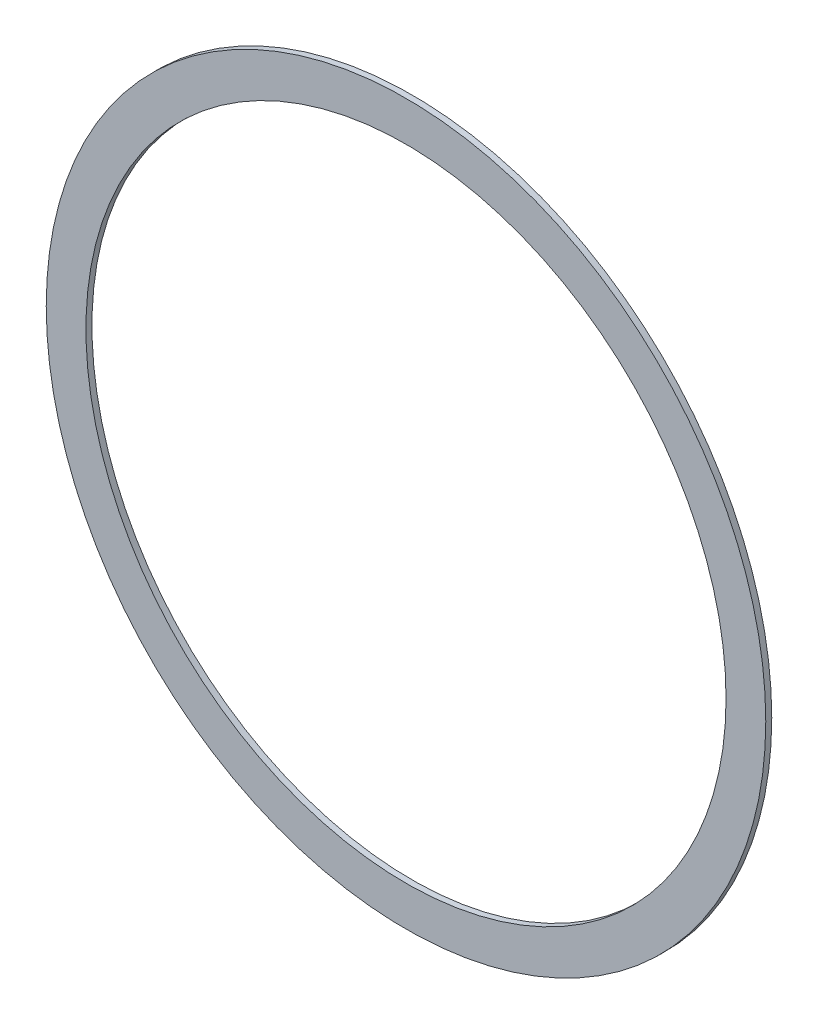
ISO-10303-21;
HEADER;
FILE_DESCRIPTION(('STEP AP214'),'2;1');
FILE_NAME('part.step','',(''),(''),'','','');
FILE_SCHEMA(('AUTOMOTIVE_DESIGN { 1 0 10303 214 1 1 1 1 }'));
ENDSEC;
DATA;
#1=APPLICATION_CONTEXT('core data for automotive mechanical design processes');
#2=APPLICATION_PROTOCOL_DEFINITION('international standard','automotive_design',2000,#1);
#3=PRODUCT_CONTEXT('',#1,'mechanical');
#4=PRODUCT('Part','Part','',(#3));
#5=PRODUCT_RELATED_PRODUCT_CATEGORY('part','',(#4));
#6=PRODUCT_DEFINITION_FORMATION('','',#4);
#7=PRODUCT_DEFINITION_CONTEXT('part definition',#1,'design');
#8=PRODUCT_DEFINITION('design','',#6,#7);
#9=PRODUCT_DEFINITION_SHAPE('','',#8);
#10=(LENGTH_UNIT() NAMED_UNIT(*) SI_UNIT(.MILLI.,.METRE.));
#11=(NAMED_UNIT(*) PLANE_ANGLE_UNIT() SI_UNIT($,.RADIAN.));
#12=(NAMED_UNIT(*) SI_UNIT($,.STERADIAN.) SOLID_ANGLE_UNIT());
#13=UNCERTAINTY_MEASURE_WITH_UNIT(LENGTH_MEASURE(1.E-05),#10,'distance_accuracy_value','');
#14=(GEOMETRIC_REPRESENTATION_CONTEXT(3) GLOBAL_UNCERTAINTY_ASSIGNED_CONTEXT((#13)) GLOBAL_UNIT_ASSIGNED_CONTEXT((#10,
#11,#12)) REPRESENTATION_CONTEXT('',''));
#15=CARTESIAN_POINT('',(0.,0.,0.));
#16=DIRECTION('',(0.,0.,1.));
#17=DIRECTION('',(1.,0.,0.));
#18=AXIS2_PLACEMENT_3D('',#15,#16,#17);
#19=CARTESIAN_POINT('',(0.,0.,3.175));
#20=DIRECTION('',(0.,0.,1.));
#21=DIRECTION('',(1.,0.,0.));
#22=AXIS2_PLACEMENT_3D('',#19,#20,#21);
#23=PLANE('',#22);
#24=CARTESIAN_POINT('',(0.,0.,3.175));
#25=DIRECTION('',(0.,0.,1.));
#26=DIRECTION('',(1.,0.,0.));
#27=AXIS2_PLACEMENT_3D('',#24,#25,#26);
#28=CIRCLE('',#27,190.5);
#29=CARTESIAN_POINT('',(190.5,0.,3.175));
#30=VERTEX_POINT('',#29);
#31=EDGE_CURVE('E10',#30,#30,#28,.T.);
#32=ORIENTED_EDGE('',*,*,#31,.T.);
#33=EDGE_LOOP('',(#32));
#34=FACE_BOUND('',#33,.T.);
#35=CARTESIAN_POINT('',(0.,0.,3.175));
#36=DIRECTION('',(0.,0.,1.));
#37=DIRECTION('',(1.,0.,0.));
#38=AXIS2_PLACEMENT_3D('',#35,#36,#37);
#39=CIRCLE('',#38,169.4688);
#40=CARTESIAN_POINT('',(169.4688,0.,3.175));
#41=VERTEX_POINT('',#40);
#42=EDGE_CURVE('E42',#41,#41,#39,.T.);
#43=ORIENTED_EDGE('',*,*,#42,.F.);
#44=EDGE_LOOP('',(#43));
#45=FACE_BOUND('',#44,.T.);
#46=ADVANCED_FACE('F31',(#34,#45),#23,.T.);
#47=CARTESIAN_POINT('',(0.,0.,0.));
#48=DIRECTION('',(0.,0.,1.));
#49=DIRECTION('',(1.,0.,0.));
#50=AXIS2_PLACEMENT_3D('',#47,#48,#49);
#51=PLANE('',#50);
#52=CARTESIAN_POINT('',(0.,0.,0.));
#53=DIRECTION('',(0.,0.,1.));
#54=DIRECTION('',(1.,0.,0.));
#55=AXIS2_PLACEMENT_3D('',#52,#53,#54);
#56=CIRCLE('',#55,190.5);
#57=CARTESIAN_POINT('',(190.5,0.,0.));
#58=VERTEX_POINT('',#57);
#59=EDGE_CURVE('E35',#58,#58,#56,.T.);
#60=ORIENTED_EDGE('',*,*,#59,.F.);
#61=EDGE_LOOP('',(#60));
#62=FACE_BOUND('',#61,.T.);
#63=CARTESIAN_POINT('',(0.,0.,0.));
#64=DIRECTION('',(0.,0.,1.));
#65=DIRECTION('',(1.,0.,0.));
#66=AXIS2_PLACEMENT_3D('',#63,#64,#65);
#67=CIRCLE('',#66,169.4688);
#68=CARTESIAN_POINT('',(169.4688,0.,0.));
#69=VERTEX_POINT('',#68);
#70=EDGE_CURVE('E44',#69,#69,#67,.T.);
#71=ORIENTED_EDGE('',*,*,#70,.T.);
#72=EDGE_LOOP('',(#71));
#73=FACE_BOUND('',#72,.T.);
#74=ADVANCED_FACE('F54',(#62,#73),#51,.F.);
#75=CARTESIAN_POINT('',(0.,0.,3.175));
#76=DIRECTION('',(0.,0.,-1.));
#77=DIRECTION('',(-1.,0.,0.));
#78=AXIS2_PLACEMENT_3D('',#75,#76,#77);
#79=CYLINDRICAL_SURFACE('',#78,190.5);
#80=ORIENTED_EDGE('',*,*,#31,.F.);
#81=EDGE_LOOP('',(#80));
#82=FACE_BOUND('',#81,.T.);
#83=ORIENTED_EDGE('',*,*,#59,.T.);
#84=EDGE_LOOP('',(#83));
#85=FACE_BOUND('',#84,.T.);
#86=ADVANCED_FACE('F33',(#82,#85),#79,.T.);
#87=CARTESIAN_POINT('',(0.,0.,3.175));
#88=DIRECTION('',(0.,0.,-1.));
#89=DIRECTION('',(-1.,0.,0.));
#90=AXIS2_PLACEMENT_3D('',#87,#88,#89);
#91=CYLINDRICAL_SURFACE('',#90,169.4688);
#92=ORIENTED_EDGE('',*,*,#42,.T.);
#93=EDGE_LOOP('',(#92));
#94=FACE_BOUND('',#93,.T.);
#95=ORIENTED_EDGE('',*,*,#70,.F.);
#96=EDGE_LOOP('',(#95));
#97=FACE_BOUND('',#96,.T.);
#98=ADVANCED_FACE('F50',(#94,#97),#91,.F.);
#99=CLOSED_SHELL('',(#46,#74,#86,#98));
#100=MANIFOLD_SOLID_BREP('B2',#99);
#101=ADVANCED_BREP_SHAPE_REPRESENTATION('',(#18,#100),#14);
#102=SHAPE_DEFINITION_REPRESENTATION(#9,#101);
ENDSEC;
END-ISO-10303-21;
